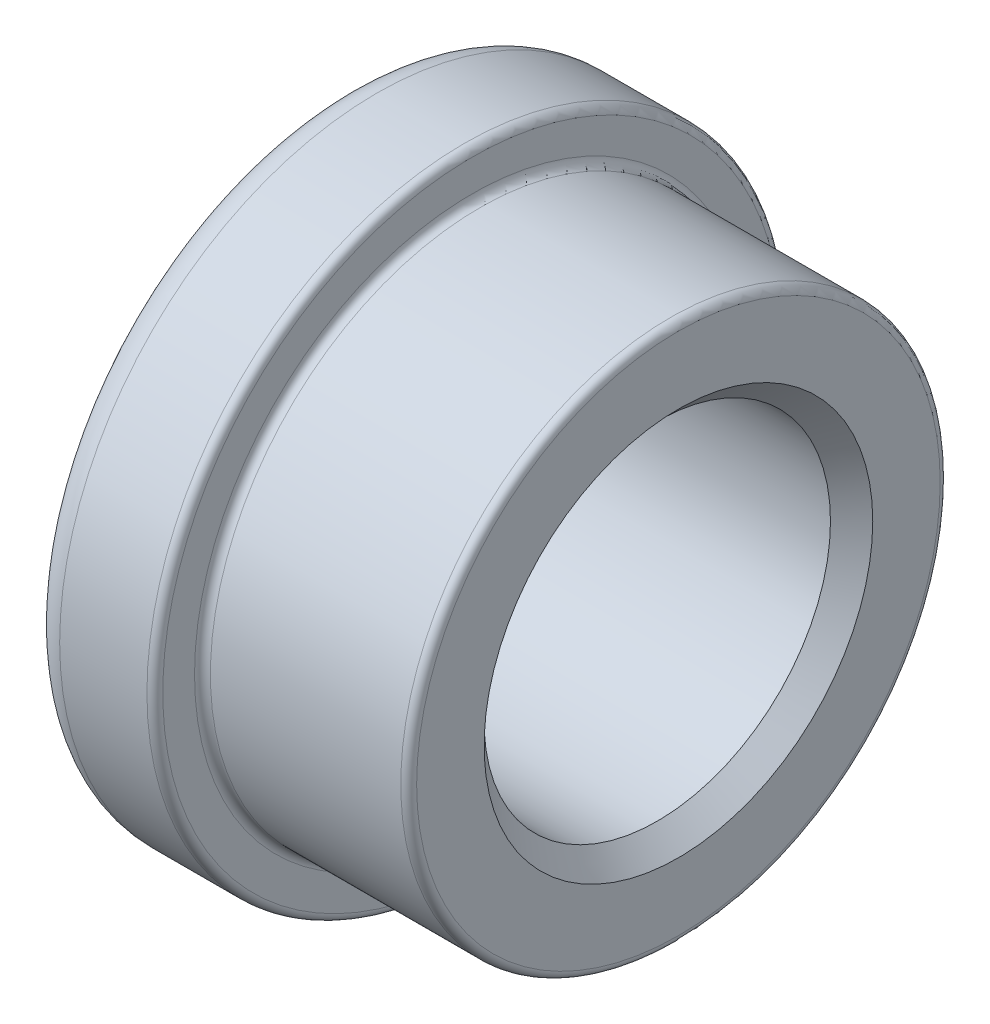
ISO-10303-21;
HEADER;
FILE_DESCRIPTION(('STEP AP214'),'2;1');
FILE_NAME('part.step','',(''),(''),'','','');
FILE_SCHEMA(('AUTOMOTIVE_DESIGN { 1 0 10303 214 1 1 1 1 }'));
ENDSEC;
DATA;
#1=APPLICATION_CONTEXT('core data for automotive mechanical design processes');
#2=APPLICATION_PROTOCOL_DEFINITION('international standard','automotive_design',2000,#1);
#3=PRODUCT_CONTEXT('',#1,'mechanical');
#4=PRODUCT('Part','Part','',(#3));
#5=PRODUCT_RELATED_PRODUCT_CATEGORY('part','',(#4));
#6=PRODUCT_DEFINITION_FORMATION('','',#4);
#7=PRODUCT_DEFINITION_CONTEXT('part definition',#1,'design');
#8=PRODUCT_DEFINITION('design','',#6,#7);
#9=PRODUCT_DEFINITION_SHAPE('','',#8);
#10=(LENGTH_UNIT() NAMED_UNIT(*) SI_UNIT(.MILLI.,.METRE.));
#11=(NAMED_UNIT(*) PLANE_ANGLE_UNIT() SI_UNIT($,.RADIAN.));
#12=(NAMED_UNIT(*) SI_UNIT($,.STERADIAN.) SOLID_ANGLE_UNIT());
#13=UNCERTAINTY_MEASURE_WITH_UNIT(LENGTH_MEASURE(1.E-05),#10,'distance_accuracy_value','');
#14=(GEOMETRIC_REPRESENTATION_CONTEXT(3) GLOBAL_UNCERTAINTY_ASSIGNED_CONTEXT((#13)) GLOBAL_UNIT_ASSIGNED_CONTEXT((#10,
#11,#12)) REPRESENTATION_CONTEXT('',''));
#15=CARTESIAN_POINT('',(0.,0.,0.));
#16=DIRECTION('',(0.,0.,1.));
#17=DIRECTION('',(1.,0.,0.));
#18=AXIS2_PLACEMENT_3D('',#15,#16,#17);
#19=CARTESIAN_POINT('',(-19.,0.,0.));
#20=DIRECTION('',(1.,0.,0.));
#21=DIRECTION('',(0.,0.,-1.));
#22=AXIS2_PLACEMENT_3D('',#19,#20,#21);
#23=TOROIDAL_SURFACE('',#22,18.,2.);
#24=CARTESIAN_POINT('',(-21.,0.,0.));
#25=DIRECTION('',(1.,0.,0.));
#26=DIRECTION('',(0.,0.,-1.));
#27=AXIS2_PLACEMENT_3D('',#24,#25,#26);
#28=CIRCLE('',#27,18.);
#29=CARTESIAN_POINT('',(-21.,0.,-18.));
#30=VERTEX_POINT('',#29);
#31=EDGE_CURVE('E10',#30,#30,#28,.T.);
#32=ORIENTED_EDGE('',*,*,#31,.T.);
#33=EDGE_LOOP('',(#32));
#34=FACE_BOUND('',#33,.T.);
#35=CARTESIAN_POINT('',(-19.,0.,0.));
#36=DIRECTION('',(1.,0.,0.));
#37=DIRECTION('',(0.,0.,-1.));
#38=AXIS2_PLACEMENT_3D('',#35,#36,#37);
#39=CIRCLE('',#38,20.);
#40=CARTESIAN_POINT('',(-19.,0.,-20.));
#41=VERTEX_POINT('',#40);
#42=EDGE_CURVE('E83',#41,#41,#39,.T.);
#43=ORIENTED_EDGE('',*,*,#42,.F.);
#44=EDGE_LOOP('',(#43));
#45=FACE_BOUND('',#44,.T.);
#46=ADVANCED_FACE('F43',(#34,#45),#23,.T.);
#47=CARTESIAN_POINT('',(-21.,18.,0.));
#48=DIRECTION('',(-1.,0.,0.));
#49=DIRECTION('',(0.,0.,1.));
#50=AXIS2_PLACEMENT_3D('',#47,#48,#49);
#51=PLANE('',#50);
#52=CARTESIAN_POINT('',(-21.,0.,0.));
#53=DIRECTION('',(1.,0.,0.));
#54=DIRECTION('',(0.,0.,-1.));
#55=AXIS2_PLACEMENT_3D('',#52,#53,#54);
#56=CIRCLE('',#55,12.25);
#57=CARTESIAN_POINT('',(-21.,0.,-12.25));
#58=VERTEX_POINT('',#57);
#59=EDGE_CURVE('E49',#58,#58,#56,.T.);
#60=ORIENTED_EDGE('',*,*,#59,.T.);
#61=EDGE_LOOP('',(#60));
#62=FACE_BOUND('',#61,.T.);
#63=ORIENTED_EDGE('',*,*,#31,.F.);
#64=EDGE_LOOP('',(#63));
#65=FACE_BOUND('',#64,.T.);
#66=ADVANCED_FACE('F91',(#62,#65),#51,.T.);
#67=CARTESIAN_POINT('',(-21.,0.,0.));
#68=DIRECTION('',(-1.,0.,0.));
#69=DIRECTION('',(0.,0.,1.));
#70=AXIS2_PLACEMENT_3D('',#67,#68,#69);
#71=CONICAL_SURFACE('',#70,12.25,0.785398163397451);
#72=CARTESIAN_POINT('',(-19.6675,0.,0.));
#73=DIRECTION('',(1.,0.,0.));
#74=DIRECTION('',(0.,0.,-1.));
#75=AXIS2_PLACEMENT_3D('',#72,#73,#74);
#76=CIRCLE('',#75,10.9175);
#77=CARTESIAN_POINT('',(-19.6675,0.,-10.9175));
#78=VERTEX_POINT('',#77);
#79=EDGE_CURVE('E53',#78,#78,#76,.T.);
#80=ORIENTED_EDGE('',*,*,#79,.T.);
#81=EDGE_LOOP('',(#80));
#82=FACE_BOUND('',#81,.T.);
#83=ORIENTED_EDGE('',*,*,#59,.F.);
#84=EDGE_LOOP('',(#83));
#85=FACE_BOUND('',#84,.T.);
#86=ADVANCED_FACE('F95',(#82,#85),#71,.F.);
#87=CARTESIAN_POINT('',(0.,0.,0.));
#88=DIRECTION('',(1.,0.,0.));
#89=DIRECTION('',(0.,0.,-1.));
#90=AXIS2_PLACEMENT_3D('',#87,#88,#89);
#91=CYLINDRICAL_SURFACE('',#90,10.9175);
#92=CARTESIAN_POINT('',(-1.3325,0.,0.));
#93=DIRECTION('',(1.,0.,0.));
#94=DIRECTION('',(0.,0.,-1.));
#95=AXIS2_PLACEMENT_3D('',#92,#93,#94);
#96=CIRCLE('',#95,10.9175);
#97=CARTESIAN_POINT('',(-1.3325,0.,-10.9175));
#98=VERTEX_POINT('',#97);
#99=EDGE_CURVE('E57',#98,#98,#96,.T.);
#100=ORIENTED_EDGE('',*,*,#99,.T.);
#101=EDGE_LOOP('',(#100));
#102=FACE_BOUND('',#101,.T.);
#103=ORIENTED_EDGE('',*,*,#79,.F.);
#104=EDGE_LOOP('',(#103));
#105=FACE_BOUND('',#104,.T.);
#106=ADVANCED_FACE('F99',(#102,#105),#91,.F.);
#107=CARTESIAN_POINT('',(-1.3325,0.,0.));
#108=DIRECTION('',(1.,0.,0.));
#109=DIRECTION('',(0.,0.,-1.));
#110=AXIS2_PLACEMENT_3D('',#107,#108,#109);
#111=CONICAL_SURFACE('',#110,10.9175,0.78539816339745);
#112=CARTESIAN_POINT('',(0.,0.,0.));
#113=DIRECTION('',(1.,0.,0.));
#114=DIRECTION('',(0.,0.,-1.));
#115=AXIS2_PLACEMENT_3D('',#112,#113,#114);
#116=CIRCLE('',#115,12.25);
#117=CARTESIAN_POINT('',(0.,0.,-12.25));
#118=VERTEX_POINT('',#117);
#119=EDGE_CURVE('E62',#118,#118,#116,.T.);
#120=ORIENTED_EDGE('',*,*,#119,.T.);
#121=EDGE_LOOP('',(#120));
#122=FACE_BOUND('',#121,.T.);
#123=ORIENTED_EDGE('',*,*,#99,.F.);
#124=EDGE_LOOP('',(#123));
#125=FACE_BOUND('',#124,.T.);
#126=ADVANCED_FACE('F106',(#122,#125),#111,.F.);
#127=CARTESIAN_POINT('',(0.,12.25,0.));
#128=DIRECTION('',(1.,0.,0.));
#129=DIRECTION('',(0.,0.,-1.));
#130=AXIS2_PLACEMENT_3D('',#127,#128,#129);
#131=PLANE('',#130);
#132=CARTESIAN_POINT('',(0.,0.,0.));
#133=DIRECTION('',(1.,0.,0.));
#134=DIRECTION('',(0.,0.,-1.));
#135=AXIS2_PLACEMENT_3D('',#132,#133,#134);
#136=CIRCLE('',#135,16.5);
#137=CARTESIAN_POINT('',(0.,0.,-16.5));
#138=VERTEX_POINT('',#137);
#139=EDGE_CURVE('E65',#138,#138,#136,.T.);
#140=ORIENTED_EDGE('',*,*,#139,.T.);
#141=EDGE_LOOP('',(#140));
#142=FACE_BOUND('',#141,.T.);
#143=ORIENTED_EDGE('',*,*,#119,.F.);
#144=EDGE_LOOP('',(#143));
#145=FACE_BOUND('',#144,.T.);
#146=ADVANCED_FACE('F110',(#142,#145),#131,.T.);
#147=CARTESIAN_POINT('',(-0.5,0.,0.));
#148=DIRECTION('',(1.,0.,0.));
#149=DIRECTION('',(0.,0.,-1.));
#150=AXIS2_PLACEMENT_3D('',#147,#148,#149);
#151=TOROIDAL_SURFACE('',#150,16.5,0.5);
#152=CARTESIAN_POINT('',(-0.5,0.,0.));
#153=DIRECTION('',(1.,0.,0.));
#154=DIRECTION('',(0.,0.,-1.));
#155=AXIS2_PLACEMENT_3D('',#152,#153,#154);
#156=CIRCLE('',#155,17.);
#157=CARTESIAN_POINT('',(-0.5,0.,-17.));
#158=VERTEX_POINT('',#157);
#159=EDGE_CURVE('E68',#158,#158,#156,.T.);
#160=ORIENTED_EDGE('',*,*,#159,.T.);
#161=EDGE_LOOP('',(#160));
#162=FACE_BOUND('',#161,.T.);
#163=ORIENTED_EDGE('',*,*,#139,.F.);
#164=EDGE_LOOP('',(#163));
#165=FACE_BOUND('',#164,.T.);
#166=ADVANCED_FACE('F114',(#162,#165),#151,.T.);
#167=CARTESIAN_POINT('',(0.,0.,0.));
#168=DIRECTION('',(1.,0.,0.));
#169=DIRECTION('',(0.,0.,-1.));
#170=AXIS2_PLACEMENT_3D('',#167,#168,#169);
#171=CYLINDRICAL_SURFACE('',#170,17.);
#172=CARTESIAN_POINT('',(-12.5,0.,0.));
#173=DIRECTION('',(1.,0.,0.));
#174=DIRECTION('',(0.,0.,-1.));
#175=AXIS2_PLACEMENT_3D('',#172,#173,#174);
#176=CIRCLE('',#175,17.);
#177=CARTESIAN_POINT('',(-12.5,0.,-17.));
#178=VERTEX_POINT('',#177);
#179=EDGE_CURVE('E71',#178,#178,#176,.T.);
#180=ORIENTED_EDGE('',*,*,#179,.T.);
#181=EDGE_LOOP('',(#180));
#182=FACE_BOUND('',#181,.T.);
#183=ORIENTED_EDGE('',*,*,#159,.F.);
#184=EDGE_LOOP('',(#183));
#185=FACE_BOUND('',#184,.T.);
#186=ADVANCED_FACE('F118',(#182,#185),#171,.T.);
#187=CARTESIAN_POINT('',(-12.5,0.,0.));
#188=DIRECTION('',(1.,0.,0.));
#189=DIRECTION('',(0.,0.,-1.));
#190=AXIS2_PLACEMENT_3D('',#187,#188,#189);
#191=TOROIDAL_SURFACE('',#190,17.5,0.5);
#192=CARTESIAN_POINT('',(-13.,0.,0.));
#193=DIRECTION('',(1.,0.,0.));
#194=DIRECTION('',(0.,0.,-1.));
#195=AXIS2_PLACEMENT_3D('',#192,#193,#194);
#196=CIRCLE('',#195,17.5);
#197=CARTESIAN_POINT('',(-13.,0.,-17.5));
#198=VERTEX_POINT('',#197);
#199=EDGE_CURVE('E74',#198,#198,#196,.T.);
#200=ORIENTED_EDGE('',*,*,#199,.T.);
#201=EDGE_LOOP('',(#200));
#202=FACE_BOUND('',#201,.T.);
#203=ORIENTED_EDGE('',*,*,#179,.F.);
#204=EDGE_LOOP('',(#203));
#205=FACE_BOUND('',#204,.T.);
#206=ADVANCED_FACE('F122',(#202,#205),#191,.F.);
#207=CARTESIAN_POINT('',(-13.,17.5,0.));
#208=DIRECTION('',(1.,0.,0.));
#209=DIRECTION('',(0.,0.,-1.));
#210=AXIS2_PLACEMENT_3D('',#207,#208,#209);
#211=PLANE('',#210);
#212=CARTESIAN_POINT('',(-13.,0.,0.));
#213=DIRECTION('',(1.,0.,0.));
#214=DIRECTION('',(0.,0.,-1.));
#215=AXIS2_PLACEMENT_3D('',#212,#213,#214);
#216=CIRCLE('',#215,19.5);
#217=CARTESIAN_POINT('',(-13.,0.,-19.5));
#218=VERTEX_POINT('',#217);
#219=EDGE_CURVE('E77',#218,#218,#216,.T.);
#220=ORIENTED_EDGE('',*,*,#219,.T.);
#221=EDGE_LOOP('',(#220));
#222=FACE_BOUND('',#221,.T.);
#223=ORIENTED_EDGE('',*,*,#199,.F.);
#224=EDGE_LOOP('',(#223));
#225=FACE_BOUND('',#224,.T.);
#226=ADVANCED_FACE('F126',(#222,#225),#211,.T.);
#227=CARTESIAN_POINT('',(-13.5,0.,0.));
#228=DIRECTION('',(1.,0.,0.));
#229=DIRECTION('',(0.,0.,-1.));
#230=AXIS2_PLACEMENT_3D('',#227,#228,#229);
#231=TOROIDAL_SURFACE('',#230,19.5,0.5);
#232=CARTESIAN_POINT('',(-13.5,0.,0.));
#233=DIRECTION('',(1.,0.,0.));
#234=DIRECTION('',(0.,0.,-1.));
#235=AXIS2_PLACEMENT_3D('',#232,#233,#234);
#236=CIRCLE('',#235,20.);
#237=CARTESIAN_POINT('',(-13.5,0.,-20.));
#238=VERTEX_POINT('',#237);
#239=EDGE_CURVE('E80',#238,#238,#236,.T.);
#240=ORIENTED_EDGE('',*,*,#239,.T.);
#241=EDGE_LOOP('',(#240));
#242=FACE_BOUND('',#241,.T.);
#243=ORIENTED_EDGE('',*,*,#219,.F.);
#244=EDGE_LOOP('',(#243));
#245=FACE_BOUND('',#244,.T.);
#246=ADVANCED_FACE('F130',(#242,#245),#231,.T.);
#247=CARTESIAN_POINT('',(0.,0.,0.));
#248=DIRECTION('',(1.,0.,0.));
#249=DIRECTION('',(0.,0.,-1.));
#250=AXIS2_PLACEMENT_3D('',#247,#248,#249);
#251=CYLINDRICAL_SURFACE('',#250,20.);
#252=ORIENTED_EDGE('',*,*,#42,.T.);
#253=EDGE_LOOP('',(#252));
#254=FACE_BOUND('',#253,.T.);
#255=ORIENTED_EDGE('',*,*,#239,.F.);
#256=EDGE_LOOP('',(#255));
#257=FACE_BOUND('',#256,.T.);
#258=ADVANCED_FACE('F87',(#254,#257),#251,.T.);
#259=CLOSED_SHELL('',(#46,#66,#86,#106,#126,#146,#166,#186,#206,#226,#246,#258));
#260=MANIFOLD_SOLID_BREP('B2',#259);
#261=ADVANCED_BREP_SHAPE_REPRESENTATION('',(#18,#260),#14);
#262=SHAPE_DEFINITION_REPRESENTATION(#9,#261);
ENDSEC;
END-ISO-10303-21;
